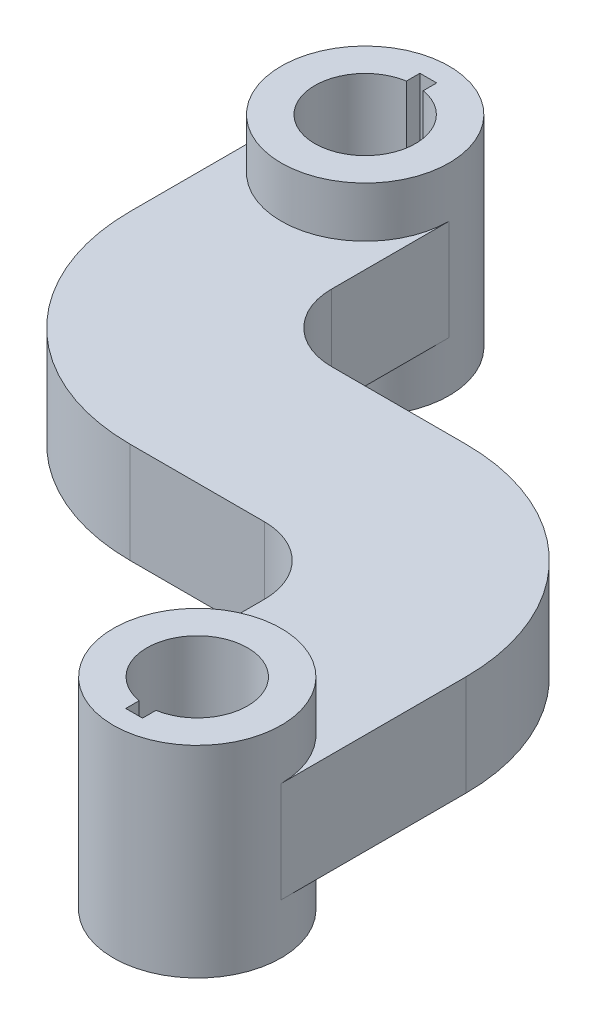
ISO-10303-21;
HEADER;
FILE_DESCRIPTION(('STEP AP214'),'2;1');
FILE_NAME('part.step','',(''),(''),'','','');
FILE_SCHEMA(('AUTOMOTIVE_DESIGN { 1 0 10303 214 1 1 1 1 }'));
ENDSEC;
DATA;
#1=APPLICATION_CONTEXT('core data for automotive mechanical design processes');
#2=APPLICATION_PROTOCOL_DEFINITION('international standard','automotive_design',2000,#1);
#3=PRODUCT_CONTEXT('',#1,'mechanical');
#4=PRODUCT('Part','Part','',(#3));
#5=PRODUCT_RELATED_PRODUCT_CATEGORY('part','',(#4));
#6=PRODUCT_DEFINITION_FORMATION('','',#4);
#7=PRODUCT_DEFINITION_CONTEXT('part definition',#1,'design');
#8=PRODUCT_DEFINITION('design','',#6,#7);
#9=PRODUCT_DEFINITION_SHAPE('','',#8);
#10=(LENGTH_UNIT() NAMED_UNIT(*) SI_UNIT(.MILLI.,.METRE.));
#11=(NAMED_UNIT(*) PLANE_ANGLE_UNIT() SI_UNIT($,.RADIAN.));
#12=(NAMED_UNIT(*) SI_UNIT($,.STERADIAN.) SOLID_ANGLE_UNIT());
#13=UNCERTAINTY_MEASURE_WITH_UNIT(LENGTH_MEASURE(1.E-05),#10,'distance_accuracy_value','');
#14=(GEOMETRIC_REPRESENTATION_CONTEXT(3) GLOBAL_UNCERTAINTY_ASSIGNED_CONTEXT((#13)) GLOBAL_UNIT_ASSIGNED_CONTEXT((#10,
#11,#12)) REPRESENTATION_CONTEXT('',''));
#15=CARTESIAN_POINT('',(0.,0.,0.));
#16=DIRECTION('',(0.,0.,1.));
#17=DIRECTION('',(1.,0.,0.));
#18=AXIS2_PLACEMENT_3D('',#15,#16,#17);
#19=CARTESIAN_POINT('',(19.05,19.05,57.15));
#20=DIRECTION('',(0.,-1.,0.));
#21=DIRECTION('',(0.,0.,-1.));
#22=AXIS2_PLACEMENT_3D('',#19,#20,#21);
#23=CYLINDRICAL_SURFACE('',#22,25.4);
#24=CARTESIAN_POINT('',(19.05,-19.05,57.15));
#25=DIRECTION('',(0.,-1.,0.));
#26=DIRECTION('',(0.,0.,1.));
#27=AXIS2_PLACEMENT_3D('',#24,#25,#26);
#28=CIRCLE('',#27,25.4);
#29=CARTESIAN_POINT('',(19.05,-19.05,31.75));
#30=VERTEX_POINT('',#29);
#31=CARTESIAN_POINT('',(44.45,-19.05,57.15));
#32=VERTEX_POINT('',#31);
#33=EDGE_CURVE('E297',#30,#32,#28,.T.);
#34=ORIENTED_EDGE('',*,*,#33,.T.);
#35=DIRECTION('',(0.,-1.,0.));
#36=VECTOR('',#35,1.);
#37=CARTESIAN_POINT('',(44.45,19.05,57.15));
#38=LINE('',#37,#36);
#39=CARTESIAN_POINT('',(44.45,19.05,57.15));
#40=VERTEX_POINT('',#39);
#41=EDGE_CURVE('E403',#40,#32,#38,.T.);
#42=ORIENTED_EDGE('',*,*,#41,.F.);
#43=CARTESIAN_POINT('',(19.05,19.05,57.15));
#44=DIRECTION('',(0.,-1.,0.));
#45=DIRECTION('',(0.,0.,1.));
#46=AXIS2_PLACEMENT_3D('',#43,#44,#45);
#47=CIRCLE('',#46,25.4);
#48=CARTESIAN_POINT('',(19.05,19.05,31.75));
#49=VERTEX_POINT('',#48);
#50=EDGE_CURVE('E302',#49,#40,#47,.T.);
#51=ORIENTED_EDGE('',*,*,#50,.F.);
#52=DIRECTION('',(0.,-1.,0.));
#53=VECTOR('',#52,1.);
#54=CARTESIAN_POINT('',(19.05,19.05,31.75));
#55=LINE('',#54,#53);
#56=EDGE_CURVE('E407',#49,#30,#55,.T.);
#57=ORIENTED_EDGE('',*,*,#56,.T.);
#58=EDGE_LOOP('',(#34,#42,#51,#57));
#59=FACE_BOUND('',#58,.T.);
#60=ADVANCED_FACE('F43',(#59),#23,.F.);
#61=CARTESIAN_POINT('',(44.45,19.05,114.3));
#62=DIRECTION('',(1.,0.,0.));
#63=DIRECTION('',(0.,0.,-1.));
#64=AXIS2_PLACEMENT_3D('',#61,#62,#63);
#65=PLANE('',#64);
#66=DIRECTION('',(0.,0.,1.));
#67=VECTOR('',#66,1.);
#68=CARTESIAN_POINT('',(44.45,-19.05,114.3));
#69=LINE('',#68,#67);
#70=CARTESIAN_POINT('',(44.45,-19.05,114.3));
#71=VERTEX_POINT('',#70);
#72=EDGE_CURVE('E335',#32,#71,#69,.T.);
#73=ORIENTED_EDGE('',*,*,#72,.T.);
#74=DIRECTION('',(0.,-1.,0.));
#75=VECTOR('',#74,1.);
#76=CARTESIAN_POINT('',(44.45,19.05,114.3));
#77=LINE('',#76,#75);
#78=CARTESIAN_POINT('',(44.45,19.05,114.3));
#79=VERTEX_POINT('',#78);
#80=EDGE_CURVE('E399',#79,#71,#77,.T.);
#81=ORIENTED_EDGE('',*,*,#80,.F.);
#82=DIRECTION('',(0.,0.,1.));
#83=VECTOR('',#82,1.);
#84=CARTESIAN_POINT('',(44.45,19.05,114.3));
#85=LINE('',#84,#83);
#86=EDGE_CURVE('E306',#40,#79,#85,.T.);
#87=ORIENTED_EDGE('',*,*,#86,.F.);
#88=ORIENTED_EDGE('',*,*,#41,.T.);
#89=EDGE_LOOP('',(#73,#81,#87,#88));
#90=FACE_BOUND('',#89,.T.);
#91=ADVANCED_FACE('F467',(#90),#65,.F.);
#92=CARTESIAN_POINT('',(76.2,19.05,114.3));
#93=DIRECTION('',(0.,-1.,0.));
#94=DIRECTION('',(0.,0.,-1.));
#95=AXIS2_PLACEMENT_3D('',#92,#93,#94);
#96=CYLINDRICAL_SURFACE('',#95,31.75);
#97=ORIENTED_EDGE('',*,*,#80,.T.);
#98=CARTESIAN_POINT('',(76.2,-19.05,114.3));
#99=DIRECTION('',(0.,-1.,0.));
#100=DIRECTION('',(0.,0.,-1.));
#101=AXIS2_PLACEMENT_3D('',#98,#99,#100);
#102=CIRCLE('',#101,31.75);
#103=CARTESIAN_POINT('',(107.95,-19.05,114.3));
#104=VERTEX_POINT('',#103);
#105=EDGE_CURVE('E11',#71,#104,#102,.T.);
#106=ORIENTED_EDGE('',*,*,#105,.T.);
#107=DIRECTION('',(0.,-1.,0.));
#108=VECTOR('',#107,1.);
#109=CARTESIAN_POINT('',(107.95,19.05,114.3));
#110=LINE('',#109,#108);
#111=CARTESIAN_POINT('',(107.95,19.05,114.3));
#112=VERTEX_POINT('',#111);
#113=EDGE_CURVE('E395',#112,#104,#110,.T.);
#114=ORIENTED_EDGE('',*,*,#113,.F.);
#115=CARTESIAN_POINT('',(76.2,19.05,114.3));
#116=DIRECTION('',(0.,-1.,0.));
#117=DIRECTION('',(0.,0.,-1.));
#118=AXIS2_PLACEMENT_3D('',#115,#116,#117);
#119=CIRCLE('',#118,31.75);
#120=EDGE_CURVE('E282',#79,#112,#119,.T.);
#121=ORIENTED_EDGE('',*,*,#120,.F.);
#122=EDGE_LOOP('',(#97,#106,#114,#121));
#123=FACE_BOUND('',#122,.T.);
#124=CARTESIAN_POINT('',(76.2,-38.1,114.3));
#125=DIRECTION('',(0.,1.,0.));
#126=DIRECTION('',(0.,0.,1.));
#127=AXIS2_PLACEMENT_3D('',#124,#125,#126);
#128=CIRCLE('',#127,31.75);
#129=CARTESIAN_POINT('',(76.2,-38.1,146.05));
#130=VERTEX_POINT('',#129);
#131=EDGE_CURVE('E278',#130,#130,#128,.T.);
#132=ORIENTED_EDGE('',*,*,#131,.T.);
#133=EDGE_LOOP('',(#132));
#134=FACE_BOUND('',#133,.T.);
#135=CARTESIAN_POINT('',(76.2,38.1,114.3));
#136=DIRECTION('',(0.,1.,0.));
#137=DIRECTION('',(0.,0.,1.));
#138=AXIS2_PLACEMENT_3D('',#135,#136,#137);
#139=CIRCLE('',#138,31.75);
#140=CARTESIAN_POINT('',(76.2,38.1,146.05));
#141=VERTEX_POINT('',#140);
#142=EDGE_CURVE('E226',#141,#141,#139,.T.);
#143=ORIENTED_EDGE('',*,*,#142,.F.);
#144=EDGE_LOOP('',(#143));
#145=FACE_BOUND('',#144,.T.);
#146=ADVANCED_FACE('F462',(#123,#134,#145),#96,.T.);
#147=CARTESIAN_POINT('',(107.95,19.05,44.45));
#148=DIRECTION('',(-1.,0.,0.));
#149=DIRECTION('',(0.,0.,1.));
#150=AXIS2_PLACEMENT_3D('',#147,#148,#149);
#151=PLANE('',#150);
#152=DIRECTION('',(0.,0.,-1.));
#153=VECTOR('',#152,1.);
#154=CARTESIAN_POINT('',(107.95,-19.05,44.45));
#155=LINE('',#154,#153);
#156=CARTESIAN_POINT('',(107.95,-19.05,44.45));
#157=VERTEX_POINT('',#156);
#158=EDGE_CURVE('E339',#104,#157,#155,.T.);
#159=ORIENTED_EDGE('',*,*,#158,.T.);
#160=DIRECTION('',(0.,-1.,0.));
#161=VECTOR('',#160,1.);
#162=CARTESIAN_POINT('',(107.95,19.05,44.45));
#163=LINE('',#162,#161);
#164=CARTESIAN_POINT('',(107.95,19.05,44.45));
#165=VERTEX_POINT('',#164);
#166=EDGE_CURVE('E391',#165,#157,#163,.T.);
#167=ORIENTED_EDGE('',*,*,#166,.F.);
#168=DIRECTION('',(0.,0.,-1.));
#169=VECTOR('',#168,1.);
#170=CARTESIAN_POINT('',(107.95,19.05,44.45));
#171=LINE('',#170,#169);
#172=EDGE_CURVE('E310',#112,#165,#171,.T.);
#173=ORIENTED_EDGE('',*,*,#172,.F.);
#174=ORIENTED_EDGE('',*,*,#113,.T.);
#175=EDGE_LOOP('',(#159,#167,#173,#174));
#176=FACE_BOUND('',#175,.T.);
#177=ADVANCED_FACE('F460',(#176),#151,.F.);
#178=CARTESIAN_POINT('',(31.75,19.05,44.45));
#179=DIRECTION('',(0.,-1.,0.));
#180=DIRECTION('',(0.,0.,-1.));
#181=AXIS2_PLACEMENT_3D('',#178,#179,#180);
#182=CYLINDRICAL_SURFACE('',#181,76.2);
#183=CARTESIAN_POINT('',(31.75,-19.05,44.45));
#184=DIRECTION('',(0.,1.,0.));
#185=DIRECTION('',(0.,0.,-1.));
#186=AXIS2_PLACEMENT_3D('',#183,#184,#185);
#187=CIRCLE('',#186,76.2);
#188=CARTESIAN_POINT('',(31.75,-19.05,-31.75));
#189=VERTEX_POINT('',#188);
#190=EDGE_CURVE('E342',#157,#189,#187,.T.);
#191=ORIENTED_EDGE('',*,*,#190,.T.);
#192=DIRECTION('',(0.,-1.,0.));
#193=VECTOR('',#192,1.);
#194=CARTESIAN_POINT('',(31.75,19.05,-31.75));
#195=LINE('',#194,#193);
#196=CARTESIAN_POINT('',(31.75,19.05,-31.75));
#197=VERTEX_POINT('',#196);
#198=EDGE_CURVE('E387',#197,#189,#195,.T.);
#199=ORIENTED_EDGE('',*,*,#198,.F.);
#200=CARTESIAN_POINT('',(31.75,19.05,44.45));
#201=DIRECTION('',(0.,1.,0.));
#202=DIRECTION('',(0.,0.,-1.));
#203=AXIS2_PLACEMENT_3D('',#200,#201,#202);
#204=CIRCLE('',#203,76.2);
#205=EDGE_CURVE('E313',#165,#197,#204,.T.);
#206=ORIENTED_EDGE('',*,*,#205,.F.);
#207=ORIENTED_EDGE('',*,*,#166,.T.);
#208=EDGE_LOOP('',(#191,#199,#206,#207));
#209=FACE_BOUND('',#208,.T.);
#210=ADVANCED_FACE('F454',(#209),#182,.T.);
#211=CARTESIAN_POINT('',(-19.0499999999998,19.05,-31.75));
#212=DIRECTION('',(0.,0.,1.));
#213=DIRECTION('',(1.,0.,0.));
#214=AXIS2_PLACEMENT_3D('',#211,#212,#213);
#215=PLANE('',#214);
#216=DIRECTION('',(-1.,0.,0.));
#217=VECTOR('',#216,1.);
#218=CARTESIAN_POINT('',(-19.0499999999998,-19.05,-31.75));
#219=LINE('',#218,#217);
#220=CARTESIAN_POINT('',(-19.05,-19.05,-31.75));
#221=VERTEX_POINT('',#220);
#222=EDGE_CURVE('E346',#189,#221,#219,.T.);
#223=ORIENTED_EDGE('',*,*,#222,.T.);
#224=DIRECTION('',(0.,-1.,0.));
#225=VECTOR('',#224,1.);
#226=CARTESIAN_POINT('',(-19.05,19.05,-31.75));
#227=LINE('',#226,#225);
#228=CARTESIAN_POINT('',(-19.05,19.05,-31.75));
#229=VERTEX_POINT('',#228);
#230=EDGE_CURVE('E383',#229,#221,#227,.T.);
#231=ORIENTED_EDGE('',*,*,#230,.F.);
#232=DIRECTION('',(-1.,0.,0.));
#233=VECTOR('',#232,1.);
#234=CARTESIAN_POINT('',(0.,19.05,-31.75));
#235=LINE('',#234,#233);
#236=EDGE_CURVE('E316',#197,#229,#235,.T.);
#237=ORIENTED_EDGE('',*,*,#236,.F.);
#238=ORIENTED_EDGE('',*,*,#198,.T.);
#239=EDGE_LOOP('',(#223,#231,#237,#238));
#240=FACE_BOUND('',#239,.T.);
#241=ADVANCED_FACE('F450',(#240),#215,.F.);
#242=CARTESIAN_POINT('',(-19.05,19.05,-57.15));
#243=DIRECTION('',(0.,-1.,0.));
#244=DIRECTION('',(0.,0.,-1.));
#245=AXIS2_PLACEMENT_3D('',#242,#243,#244);
#246=CYLINDRICAL_SURFACE('',#245,25.4);
#247=CARTESIAN_POINT('',(-19.05,-19.05,-57.15));
#248=DIRECTION('',(0.,-1.,0.));
#249=DIRECTION('',(0.,0.,1.));
#250=AXIS2_PLACEMENT_3D('',#247,#248,#249);
#251=CIRCLE('',#250,25.4);
#252=CARTESIAN_POINT('',(-44.45,-19.05,-57.1500000000002));
#253=VERTEX_POINT('',#252);
#254=EDGE_CURVE('E349',#221,#253,#251,.T.);
#255=ORIENTED_EDGE('',*,*,#254,.T.);
#256=DIRECTION('',(0.,-1.,0.));
#257=VECTOR('',#256,1.);
#258=CARTESIAN_POINT('',(-44.45,19.05,-57.1500000000002));
#259=LINE('',#258,#257);
#260=CARTESIAN_POINT('',(-44.45,19.05,-57.1500000000002));
#261=VERTEX_POINT('',#260);
#262=EDGE_CURVE('E379',#261,#253,#259,.T.);
#263=ORIENTED_EDGE('',*,*,#262,.F.);
#264=CARTESIAN_POINT('',(-19.05,19.05,-57.15));
#265=DIRECTION('',(0.,-1.,0.));
#266=DIRECTION('',(0.,0.,1.));
#267=AXIS2_PLACEMENT_3D('',#264,#265,#266);
#268=CIRCLE('',#267,25.4);
#269=EDGE_CURVE('E319',#229,#261,#268,.T.);
#270=ORIENTED_EDGE('',*,*,#269,.F.);
#271=ORIENTED_EDGE('',*,*,#230,.T.);
#272=EDGE_LOOP('',(#255,#263,#270,#271));
#273=FACE_BOUND('',#272,.T.);
#274=ADVANCED_FACE('F446',(#273),#246,.F.);
#275=CARTESIAN_POINT('',(-44.45,19.05,-101.6));
#276=DIRECTION('',(-1.,0.,0.));
#277=DIRECTION('',(0.,0.,1.));
#278=AXIS2_PLACEMENT_3D('',#275,#276,#277);
#279=PLANE('',#278);
#280=DIRECTION('',(0.,0.,-1.));
#281=VECTOR('',#280,1.);
#282=CARTESIAN_POINT('',(-44.45,-19.05,-101.6));
#283=LINE('',#282,#281);
#284=CARTESIAN_POINT('',(-44.45,-19.05,-101.6));
#285=VERTEX_POINT('',#284);
#286=EDGE_CURVE('E352',#253,#285,#283,.T.);
#287=ORIENTED_EDGE('',*,*,#286,.T.);
#288=DIRECTION('',(0.,-1.,0.));
#289=VECTOR('',#288,1.);
#290=CARTESIAN_POINT('',(-44.45,19.05,-101.6));
#291=LINE('',#290,#289);
#292=CARTESIAN_POINT('',(-44.45,19.05,-101.6));
#293=VERTEX_POINT('',#292);
#294=EDGE_CURVE('E375',#293,#285,#291,.T.);
#295=ORIENTED_EDGE('',*,*,#294,.F.);
#296=DIRECTION('',(0.,0.,-1.));
#297=VECTOR('',#296,1.);
#298=CARTESIAN_POINT('',(-44.45,19.05,-101.6));
#299=LINE('',#298,#297);
#300=EDGE_CURVE('E322',#261,#293,#299,.T.);
#301=ORIENTED_EDGE('',*,*,#300,.F.);
#302=ORIENTED_EDGE('',*,*,#262,.T.);
#303=EDGE_LOOP('',(#287,#295,#301,#302));
#304=FACE_BOUND('',#303,.T.);
#305=ADVANCED_FACE('F442',(#304),#279,.F.);
#306=CARTESIAN_POINT('',(-76.2,19.05,-101.6));
#307=DIRECTION('',(0.,-1.,0.));
#308=DIRECTION('',(0.,0.,-1.));
#309=AXIS2_PLACEMENT_3D('',#306,#307,#308);
#310=CYLINDRICAL_SURFACE('',#309,31.75);
#311=ORIENTED_EDGE('',*,*,#294,.T.);
#312=CARTESIAN_POINT('',(-76.2,-19.05,-101.6));
#313=DIRECTION('',(0.,-1.,0.));
#314=DIRECTION('',(0.,0.,-1.));
#315=AXIS2_PLACEMENT_3D('',#312,#313,#314);
#316=CIRCLE('',#315,31.75);
#317=CARTESIAN_POINT('',(-107.95,-19.05,-101.6));
#318=VERTEX_POINT('',#317);
#319=EDGE_CURVE('E51',#285,#318,#316,.T.);
#320=ORIENTED_EDGE('',*,*,#319,.T.);
#321=DIRECTION('',(0.,-1.,0.));
#322=VECTOR('',#321,1.);
#323=CARTESIAN_POINT('',(-107.95,19.05,-101.6));
#324=LINE('',#323,#322);
#325=CARTESIAN_POINT('',(-107.95,19.05,-101.6));
#326=VERTEX_POINT('',#325);
#327=EDGE_CURVE('E371',#326,#318,#324,.T.);
#328=ORIENTED_EDGE('',*,*,#327,.F.);
#329=CARTESIAN_POINT('',(-76.2,19.05,-101.6));
#330=DIRECTION('',(0.,-1.,0.));
#331=DIRECTION('',(0.,0.,-1.));
#332=AXIS2_PLACEMENT_3D('',#329,#330,#331);
#333=CIRCLE('',#332,31.75);
#334=EDGE_CURVE('E293',#293,#326,#333,.T.);
#335=ORIENTED_EDGE('',*,*,#334,.F.);
#336=EDGE_LOOP('',(#311,#320,#328,#335));
#337=FACE_BOUND('',#336,.T.);
#338=CARTESIAN_POINT('',(-76.2,-38.1,-101.6));
#339=DIRECTION('',(0.,1.,0.));
#340=DIRECTION('',(0.,0.,1.));
#341=AXIS2_PLACEMENT_3D('',#338,#339,#340);
#342=CIRCLE('',#341,31.75);
#343=CARTESIAN_POINT('',(-76.2,-38.1,-69.85));
#344=VERTEX_POINT('',#343);
#345=EDGE_CURVE('E289',#344,#344,#342,.T.);
#346=ORIENTED_EDGE('',*,*,#345,.T.);
#347=EDGE_LOOP('',(#346));
#348=FACE_BOUND('',#347,.T.);
#349=CARTESIAN_POINT('',(-76.2,38.1,-101.6));
#350=DIRECTION('',(0.,1.,0.));
#351=DIRECTION('',(0.,0.,1.));
#352=AXIS2_PLACEMENT_3D('',#349,#350,#351);
#353=CIRCLE('',#352,31.75);
#354=CARTESIAN_POINT('',(-76.2,38.1,-69.85));
#355=VERTEX_POINT('',#354);
#356=EDGE_CURVE('E285',#355,#355,#353,.T.);
#357=ORIENTED_EDGE('',*,*,#356,.F.);
#358=EDGE_LOOP('',(#357));
#359=FACE_BOUND('',#358,.T.);
#360=ADVANCED_FACE('F415',(#337,#348,#359),#310,.T.);
#361=CARTESIAN_POINT('',(-107.95,19.05,-44.4500000000005));
#362=DIRECTION('',(1.,0.,0.));
#363=DIRECTION('',(0.,0.,-1.));
#364=AXIS2_PLACEMENT_3D('',#361,#362,#363);
#365=PLANE('',#364);
#366=DIRECTION('',(0.,0.,1.));
#367=VECTOR('',#366,1.);
#368=CARTESIAN_POINT('',(-107.95,-19.05,-44.4500000000005));
#369=LINE('',#368,#367);
#370=CARTESIAN_POINT('',(-107.95,-19.05,-44.4500000000005));
#371=VERTEX_POINT('',#370);
#372=EDGE_CURVE('E356',#318,#371,#369,.T.);
#373=ORIENTED_EDGE('',*,*,#372,.T.);
#374=DIRECTION('',(0.,-1.,0.));
#375=VECTOR('',#374,1.);
#376=CARTESIAN_POINT('',(-107.95,19.05,-44.4500000000005));
#377=LINE('',#376,#375);
#378=CARTESIAN_POINT('',(-107.95,19.05,-44.4500000000005));
#379=VERTEX_POINT('',#378);
#380=EDGE_CURVE('E367',#379,#371,#377,.T.);
#381=ORIENTED_EDGE('',*,*,#380,.F.);
#382=DIRECTION('',(0.,0.,1.));
#383=VECTOR('',#382,1.);
#384=CARTESIAN_POINT('',(-107.95,19.05,-44.4500000000005));
#385=LINE('',#384,#383);
#386=EDGE_CURVE('E325',#326,#379,#385,.T.);
#387=ORIENTED_EDGE('',*,*,#386,.F.);
#388=ORIENTED_EDGE('',*,*,#327,.T.);
#389=EDGE_LOOP('',(#373,#381,#387,#388));
#390=FACE_BOUND('',#389,.T.);
#391=ADVANCED_FACE('F423',(#390),#365,.F.);
#392=CARTESIAN_POINT('',(-31.75,19.05,-44.45));
#393=DIRECTION('',(0.,-1.,0.));
#394=DIRECTION('',(0.,0.,-1.));
#395=AXIS2_PLACEMENT_3D('',#392,#393,#394);
#396=CYLINDRICAL_SURFACE('',#395,76.2);
#397=CARTESIAN_POINT('',(-31.75,-19.05,-44.45));
#398=DIRECTION('',(0.,1.,0.));
#399=DIRECTION('',(0.,0.,-1.));
#400=AXIS2_PLACEMENT_3D('',#397,#398,#399);
#401=CIRCLE('',#400,76.2);
#402=CARTESIAN_POINT('',(-31.7499999999995,-19.05,31.75));
#403=VERTEX_POINT('',#402);
#404=EDGE_CURVE('E359',#371,#403,#401,.T.);
#405=ORIENTED_EDGE('',*,*,#404,.T.);
#406=DIRECTION('',(0.,-1.,0.));
#407=VECTOR('',#406,1.);
#408=CARTESIAN_POINT('',(-31.7499999999995,19.05,31.75));
#409=LINE('',#408,#407);
#410=CARTESIAN_POINT('',(-31.7499999999995,19.05,31.75));
#411=VERTEX_POINT('',#410);
#412=EDGE_CURVE('E332',#411,#403,#409,.T.);
#413=ORIENTED_EDGE('',*,*,#412,.F.);
#414=CARTESIAN_POINT('',(-31.75,19.05,-44.45));
#415=DIRECTION('',(0.,1.,0.));
#416=DIRECTION('',(0.,0.,-1.));
#417=AXIS2_PLACEMENT_3D('',#414,#415,#416);
#418=CIRCLE('',#417,76.2);
#419=EDGE_CURVE('E328',#379,#411,#418,.T.);
#420=ORIENTED_EDGE('',*,*,#419,.F.);
#421=ORIENTED_EDGE('',*,*,#380,.T.);
#422=EDGE_LOOP('',(#405,#413,#420,#421));
#423=FACE_BOUND('',#422,.T.);
#424=ADVANCED_FACE('F431',(#423),#396,.T.);
#425=CARTESIAN_POINT('',(0.,19.05,31.75));
#426=DIRECTION('',(0.,0.,-1.));
#427=DIRECTION('',(-1.,0.,0.));
#428=AXIS2_PLACEMENT_3D('',#425,#426,#427);
#429=PLANE('',#428);
#430=DIRECTION('',(1.,0.,0.));
#431=VECTOR('',#430,1.);
#432=CARTESIAN_POINT('',(0.,-19.05,31.75));
#433=LINE('',#432,#431);
#434=EDGE_CURVE('E303',#403,#30,#433,.T.);
#435=ORIENTED_EDGE('',*,*,#434,.T.);
#436=ORIENTED_EDGE('',*,*,#56,.F.);
#437=DIRECTION('',(1.,0.,0.));
#438=VECTOR('',#437,1.);
#439=CARTESIAN_POINT('',(19.05,19.05,31.75));
#440=LINE('',#439,#438);
#441=EDGE_CURVE('E298',#411,#49,#440,.T.);
#442=ORIENTED_EDGE('',*,*,#441,.F.);
#443=ORIENTED_EDGE('',*,*,#412,.T.);
#444=EDGE_LOOP('',(#435,#436,#442,#443));
#445=FACE_BOUND('',#444,.T.);
#446=ADVANCED_FACE('F434',(#445),#429,.F.);
#447=CARTESIAN_POINT('',(-31.75,19.05,-44.45));
#448=DIRECTION('',(0.,-1.,0.));
#449=DIRECTION('',(0.,0.,-1.));
#450=AXIS2_PLACEMENT_3D('',#447,#448,#449);
#451=PLANE('',#450);
#452=ORIENTED_EDGE('',*,*,#86,.T.);
#453=ORIENTED_EDGE('',*,*,#120,.T.);
#454=ORIENTED_EDGE('',*,*,#172,.T.);
#455=ORIENTED_EDGE('',*,*,#205,.T.);
#456=ORIENTED_EDGE('',*,*,#236,.T.);
#457=ORIENTED_EDGE('',*,*,#269,.T.);
#458=ORIENTED_EDGE('',*,*,#300,.T.);
#459=ORIENTED_EDGE('',*,*,#334,.T.);
#460=ORIENTED_EDGE('',*,*,#386,.T.);
#461=ORIENTED_EDGE('',*,*,#419,.T.);
#462=ORIENTED_EDGE('',*,*,#441,.T.);
#463=ORIENTED_EDGE('',*,*,#50,.T.);
#464=EDGE_LOOP('',(#452,#453,#454,#455,#456,#457,#458,#459,#460,#461,#462,#463));
#465=FACE_BOUND('',#464,.T.);
#466=ADVANCED_FACE('F437',(#465),#451,.F.);
#467=CARTESIAN_POINT('',(-31.75,-19.05,-44.45));
#468=DIRECTION('',(0.,-1.,0.));
#469=DIRECTION('',(0.,0.,-1.));
#470=AXIS2_PLACEMENT_3D('',#467,#468,#469);
#471=PLANE('',#470);
#472=ORIENTED_EDGE('',*,*,#105,.F.);
#473=ORIENTED_EDGE('',*,*,#72,.F.);
#474=ORIENTED_EDGE('',*,*,#33,.F.);
#475=ORIENTED_EDGE('',*,*,#434,.F.);
#476=ORIENTED_EDGE('',*,*,#404,.F.);
#477=ORIENTED_EDGE('',*,*,#372,.F.);
#478=ORIENTED_EDGE('',*,*,#319,.F.);
#479=ORIENTED_EDGE('',*,*,#286,.F.);
#480=ORIENTED_EDGE('',*,*,#254,.F.);
#481=ORIENTED_EDGE('',*,*,#222,.F.);
#482=ORIENTED_EDGE('',*,*,#190,.F.);
#483=ORIENTED_EDGE('',*,*,#158,.F.);
#484=EDGE_LOOP('',(#472,#473,#474,#475,#476,#477,#478,#479,#480,#481,#482,#483));
#485=FACE_BOUND('',#484,.T.);
#486=ADVANCED_FACE('F426',(#485),#471,.T.);
#487=CARTESIAN_POINT('',(-76.2,-38.1,-101.6));
#488=DIRECTION('',(0.,1.,0.));
#489=DIRECTION('',(0.,0.,1.));
#490=AXIS2_PLACEMENT_3D('',#487,#488,#489);
#491=PLANE('',#490);
#492=CARTESIAN_POINT('',(-76.2,-38.1,-101.6));
#493=DIRECTION('',(0.,1.,0.));
#494=DIRECTION('',(0.,0.,1.));
#495=AXIS2_PLACEMENT_3D('',#492,#493,#494);
#496=CIRCLE('',#495,19.05);
#497=CARTESIAN_POINT('',(-79.375,-38.1,-120.383553311341));
#498=VERTEX_POINT('',#497);
#499=CARTESIAN_POINT('',(-73.025,-38.1,-120.383553311341));
#500=VERTEX_POINT('',#499);
#501=EDGE_CURVE('E189',#498,#500,#496,.T.);
#502=ORIENTED_EDGE('',*,*,#501,.T.);
#503=DIRECTION('',(0.,0.,-1.));
#504=VECTOR('',#503,1.);
#505=CARTESIAN_POINT('',(-73.025,-38.1,-125.476));
#506=LINE('',#505,#504);
#507=CARTESIAN_POINT('',(-73.025,-38.1,-125.476));
#508=VERTEX_POINT('',#507);
#509=EDGE_CURVE('E182',#500,#508,#506,.T.);
#510=ORIENTED_EDGE('',*,*,#509,.T.);
#511=DIRECTION('',(-1.,0.,0.));
#512=VECTOR('',#511,1.);
#513=CARTESIAN_POINT('',(-79.375,-38.1,-125.476));
#514=LINE('',#513,#512);
#515=CARTESIAN_POINT('',(-79.375,-38.1,-125.476));
#516=VERTEX_POINT('',#515);
#517=EDGE_CURVE('E192',#508,#516,#514,.T.);
#518=ORIENTED_EDGE('',*,*,#517,.T.);
#519=DIRECTION('',(0.,0.,1.));
#520=VECTOR('',#519,1.);
#521=CARTESIAN_POINT('',(-79.375,-38.1,-125.476));
#522=LINE('',#521,#520);
#523=EDGE_CURVE('E58',#516,#498,#522,.T.);
#524=ORIENTED_EDGE('',*,*,#523,.T.);
#525=EDGE_LOOP('',(#502,#510,#518,#524));
#526=FACE_BOUND('',#525,.T.);
#527=ORIENTED_EDGE('',*,*,#345,.F.);
#528=EDGE_LOOP('',(#527));
#529=FACE_BOUND('',#528,.T.);
#530=ADVANCED_FACE('F197',(#526,#529),#491,.F.);
#531=CARTESIAN_POINT('',(-76.2,38.1,-101.6));
#532=DIRECTION('',(0.,1.,0.));
#533=DIRECTION('',(0.,0.,1.));
#534=AXIS2_PLACEMENT_3D('',#531,#532,#533);
#535=PLANE('',#534);
#536=DIRECTION('',(0.,0.,-1.));
#537=VECTOR('',#536,1.);
#538=CARTESIAN_POINT('',(-73.025,38.1,-125.476));
#539=LINE('',#538,#537);
#540=CARTESIAN_POINT('',(-73.025,38.1,-120.383553311341));
#541=VERTEX_POINT('',#540);
#542=CARTESIAN_POINT('',(-73.025,38.1,-125.476));
#543=VERTEX_POINT('',#542);
#544=EDGE_CURVE('E66',#541,#543,#539,.T.);
#545=ORIENTED_EDGE('',*,*,#544,.F.);
#546=CARTESIAN_POINT('',(-76.2,38.1,-101.6));
#547=DIRECTION('',(0.,1.,0.));
#548=DIRECTION('',(0.,0.,1.));
#549=AXIS2_PLACEMENT_3D('',#546,#547,#548);
#550=CIRCLE('',#549,19.05);
#551=CARTESIAN_POINT('',(-79.375,38.1,-120.383553311341));
#552=VERTEX_POINT('',#551);
#553=EDGE_CURVE('E201',#552,#541,#550,.T.);
#554=ORIENTED_EDGE('',*,*,#553,.F.);
#555=DIRECTION('',(0.,0.,1.));
#556=VECTOR('',#555,1.);
#557=CARTESIAN_POINT('',(-79.375,38.1,-125.476));
#558=LINE('',#557,#556);
#559=CARTESIAN_POINT('',(-79.375,38.1,-125.476));
#560=VERTEX_POINT('',#559);
#561=EDGE_CURVE('E207',#560,#552,#558,.T.);
#562=ORIENTED_EDGE('',*,*,#561,.F.);
#563=DIRECTION('',(-1.,0.,0.));
#564=VECTOR('',#563,1.);
#565=CARTESIAN_POINT('',(-79.375,38.1,-125.476));
#566=LINE('',#565,#564);
#567=EDGE_CURVE('E216',#543,#560,#566,.T.);
#568=ORIENTED_EDGE('',*,*,#567,.F.);
#569=EDGE_LOOP('',(#545,#554,#562,#568));
#570=FACE_BOUND('',#569,.T.);
#571=ORIENTED_EDGE('',*,*,#356,.T.);
#572=EDGE_LOOP('',(#571));
#573=FACE_BOUND('',#572,.T.);
#574=ADVANCED_FACE('F503',(#570,#573),#535,.T.);
#575=CARTESIAN_POINT('',(76.2,-38.1,114.3));
#576=DIRECTION('',(0.,1.,0.));
#577=DIRECTION('',(0.,0.,1.));
#578=AXIS2_PLACEMENT_3D('',#575,#576,#577);
#579=PLANE('',#578);
#580=DIRECTION('',(1.,0.,0.));
#581=VECTOR('',#580,1.);
#582=CARTESIAN_POINT('',(73.0249999999994,-38.1,138.176));
#583=LINE('',#582,#581);
#584=CARTESIAN_POINT('',(73.0249999999994,-38.1,138.176));
#585=VERTEX_POINT('',#584);
#586=CARTESIAN_POINT('',(79.3749999999994,-38.1,138.176));
#587=VERTEX_POINT('',#586);
#588=EDGE_CURVE('E245',#585,#587,#583,.T.);
#589=ORIENTED_EDGE('',*,*,#588,.T.);
#590=DIRECTION('',(1.1445718012646E-13,0.,-1.));
#591=VECTOR('',#590,1.);
#592=CARTESIAN_POINT('',(79.3749999999994,-38.1,138.176));
#593=LINE('',#592,#591);
#594=CARTESIAN_POINT('',(79.375,-38.1,133.083553311341));
#595=VERTEX_POINT('',#594);
#596=EDGE_CURVE('E232',#587,#595,#593,.T.);
#597=ORIENTED_EDGE('',*,*,#596,.T.);
#598=CARTESIAN_POINT('',(76.2,-38.1,114.3));
#599=DIRECTION('',(0.,1.,0.));
#600=DIRECTION('',(0.,0.,1.));
#601=AXIS2_PLACEMENT_3D('',#598,#599,#600);
#602=CIRCLE('',#601,19.05);
#603=CARTESIAN_POINT('',(73.025,-38.1,133.083553311341));
#604=VERTEX_POINT('',#603);
#605=EDGE_CURVE('E236',#595,#604,#602,.T.);
#606=ORIENTED_EDGE('',*,*,#605,.T.);
#607=DIRECTION('',(-1.1445718012646E-13,0.,1.));
#608=VECTOR('',#607,1.);
#609=CARTESIAN_POINT('',(73.0249999999994,-38.1,138.176));
#610=LINE('',#609,#608);
#611=EDGE_CURVE('E241',#604,#585,#610,.T.);
#612=ORIENTED_EDGE('',*,*,#611,.T.);
#613=EDGE_LOOP('',(#589,#597,#606,#612));
#614=FACE_BOUND('',#613,.T.);
#615=ORIENTED_EDGE('',*,*,#131,.F.);
#616=EDGE_LOOP('',(#615));
#617=FACE_BOUND('',#616,.T.);
#618=ADVANCED_FACE('F506',(#614,#617),#579,.F.);
#619=CARTESIAN_POINT('',(76.2,38.1,114.3));
#620=DIRECTION('',(0.,1.,0.));
#621=DIRECTION('',(0.,0.,1.));
#622=AXIS2_PLACEMENT_3D('',#619,#620,#621);
#623=PLANE('',#622);
#624=DIRECTION('',(1.1445718012646E-13,0.,-1.));
#625=VECTOR('',#624,1.);
#626=CARTESIAN_POINT('',(79.3749999999994,38.1,138.176));
#627=LINE('',#626,#625);
#628=CARTESIAN_POINT('',(79.3749999999994,38.1,138.176));
#629=VERTEX_POINT('',#628);
#630=CARTESIAN_POINT('',(79.375,38.1,133.083553311341));
#631=VERTEX_POINT('',#630);
#632=EDGE_CURVE('E250',#629,#631,#627,.T.);
#633=ORIENTED_EDGE('',*,*,#632,.F.);
#634=DIRECTION('',(1.,0.,0.));
#635=VECTOR('',#634,1.);
#636=CARTESIAN_POINT('',(73.0249999999994,38.1,138.176));
#637=LINE('',#636,#635);
#638=CARTESIAN_POINT('',(73.0249999999994,38.1,138.176));
#639=VERTEX_POINT('',#638);
#640=EDGE_CURVE('E237',#639,#629,#637,.T.);
#641=ORIENTED_EDGE('',*,*,#640,.F.);
#642=DIRECTION('',(-1.1445718012646E-13,0.,1.));
#643=VECTOR('',#642,1.);
#644=CARTESIAN_POINT('',(73.0249999999994,38.1,138.176));
#645=LINE('',#644,#643);
#646=CARTESIAN_POINT('',(73.025,38.1,133.083553311341));
#647=VERTEX_POINT('',#646);
#648=EDGE_CURVE('E257',#647,#639,#645,.T.);
#649=ORIENTED_EDGE('',*,*,#648,.F.);
#650=CARTESIAN_POINT('',(76.2,38.1,114.3));
#651=DIRECTION('',(0.,1.,0.));
#652=DIRECTION('',(0.,0.,1.));
#653=AXIS2_PLACEMENT_3D('',#650,#651,#652);
#654=CIRCLE('',#653,19.05);
#655=EDGE_CURVE('E253',#631,#647,#654,.T.);
#656=ORIENTED_EDGE('',*,*,#655,.F.);
#657=EDGE_LOOP('',(#633,#641,#649,#656));
#658=FACE_BOUND('',#657,.T.);
#659=ORIENTED_EDGE('',*,*,#142,.T.);
#660=EDGE_LOOP('',(#659));
#661=FACE_BOUND('',#660,.T.);
#662=ADVANCED_FACE('F510',(#658,#661),#623,.T.);
#663=CARTESIAN_POINT('',(79.3749999999994,-38.1,138.176));
#664=DIRECTION('',(1.,0.,1.1445718012646E-13));
#665=DIRECTION('',(1.1445718012646E-13,0.,-1.));
#666=AXIS2_PLACEMENT_3D('',#663,#664,#665);
#667=PLANE('',#666);
#668=ORIENTED_EDGE('',*,*,#632,.T.);
#669=DIRECTION('',(0.,1.,0.));
#670=VECTOR('',#669,1.);
#671=CARTESIAN_POINT('',(79.375,-38.1,133.083553311341));
#672=LINE('',#671,#670);
#673=EDGE_CURVE('E249',#595,#631,#672,.T.);
#674=ORIENTED_EDGE('',*,*,#673,.F.);
#675=ORIENTED_EDGE('',*,*,#596,.F.);
#676=DIRECTION('',(0.,1.,0.));
#677=VECTOR('',#676,1.);
#678=CARTESIAN_POINT('',(79.3749999999994,-38.1,138.176));
#679=LINE('',#678,#677);
#680=EDGE_CURVE('E217',#587,#629,#679,.T.);
#681=ORIENTED_EDGE('',*,*,#680,.T.);
#682=EDGE_LOOP('',(#668,#674,#675,#681));
#683=FACE_BOUND('',#682,.T.);
#684=ADVANCED_FACE('F514',(#683),#667,.F.);
#685=CARTESIAN_POINT('',(73.0249999999994,-38.1,138.176));
#686=DIRECTION('',(0.,0.,1.));
#687=DIRECTION('',(1.,0.,0.));
#688=AXIS2_PLACEMENT_3D('',#685,#686,#687);
#689=PLANE('',#688);
#690=ORIENTED_EDGE('',*,*,#640,.T.);
#691=ORIENTED_EDGE('',*,*,#680,.F.);
#692=ORIENTED_EDGE('',*,*,#588,.F.);
#693=DIRECTION('',(0.,1.,0.));
#694=VECTOR('',#693,1.);
#695=CARTESIAN_POINT('',(73.0249999999994,-38.1,138.176));
#696=LINE('',#695,#694);
#697=EDGE_CURVE('E266',#585,#639,#696,.T.);
#698=ORIENTED_EDGE('',*,*,#697,.T.);
#699=EDGE_LOOP('',(#690,#691,#692,#698));
#700=FACE_BOUND('',#699,.T.);
#701=ADVANCED_FACE('F518',(#700),#689,.F.);
#702=CARTESIAN_POINT('',(73.0249999999994,-38.1,138.176));
#703=DIRECTION('',(-1.,0.,-1.1445718012646E-13));
#704=DIRECTION('',(-1.1445718012646E-13,0.,1.));
#705=AXIS2_PLACEMENT_3D('',#702,#703,#704);
#706=PLANE('',#705);
#707=ORIENTED_EDGE('',*,*,#648,.T.);
#708=ORIENTED_EDGE('',*,*,#697,.F.);
#709=ORIENTED_EDGE('',*,*,#611,.F.);
#710=DIRECTION('',(0.,1.,0.));
#711=VECTOR('',#710,1.);
#712=CARTESIAN_POINT('',(73.025,-38.1,133.083553311341));
#713=LINE('',#712,#711);
#714=EDGE_CURVE('E269',#604,#647,#713,.T.);
#715=ORIENTED_EDGE('',*,*,#714,.T.);
#716=EDGE_LOOP('',(#707,#708,#709,#715));
#717=FACE_BOUND('',#716,.T.);
#718=ADVANCED_FACE('F523',(#717),#706,.F.);
#719=CARTESIAN_POINT('',(76.2,-38.1,114.3));
#720=DIRECTION('',(0.,1.,0.));
#721=DIRECTION('',(0.,0.,1.));
#722=AXIS2_PLACEMENT_3D('',#719,#720,#721);
#723=CYLINDRICAL_SURFACE('',#722,19.05);
#724=ORIENTED_EDGE('',*,*,#655,.T.);
#725=ORIENTED_EDGE('',*,*,#714,.F.);
#726=ORIENTED_EDGE('',*,*,#605,.F.);
#727=ORIENTED_EDGE('',*,*,#673,.T.);
#728=EDGE_LOOP('',(#724,#725,#726,#727));
#729=FACE_BOUND('',#728,.T.);
#730=ADVANCED_FACE('F520',(#729),#723,.F.);
#731=CARTESIAN_POINT('',(-73.025,-38.1,-125.476));
#732=DIRECTION('',(1.,0.,0.));
#733=DIRECTION('',(0.,0.,-1.));
#734=AXIS2_PLACEMENT_3D('',#731,#732,#733);
#735=PLANE('',#734);
#736=ORIENTED_EDGE('',*,*,#544,.T.);
#737=DIRECTION('',(0.,1.,0.));
#738=VECTOR('',#737,1.);
#739=CARTESIAN_POINT('',(-73.025,-38.1,-125.476));
#740=LINE('',#739,#738);
#741=EDGE_CURVE('E178',#508,#543,#740,.T.);
#742=ORIENTED_EDGE('',*,*,#741,.F.);
#743=ORIENTED_EDGE('',*,*,#509,.F.);
#744=DIRECTION('',(0.,1.,0.));
#745=VECTOR('',#744,1.);
#746=CARTESIAN_POINT('',(-73.025,-38.1,-120.383553311341));
#747=LINE('',#746,#745);
#748=EDGE_CURVE('E223',#500,#541,#747,.T.);
#749=ORIENTED_EDGE('',*,*,#748,.T.);
#750=EDGE_LOOP('',(#736,#742,#743,#749));
#751=FACE_BOUND('',#750,.T.);
#752=ADVANCED_FACE('F180',(#751),#735,.F.);
#753=CARTESIAN_POINT('',(-76.2,-38.1,-101.6));
#754=DIRECTION('',(0.,1.,0.));
#755=DIRECTION('',(0.,0.,1.));
#756=AXIS2_PLACEMENT_3D('',#753,#754,#755);
#757=CYLINDRICAL_SURFACE('',#756,19.05);
#758=ORIENTED_EDGE('',*,*,#553,.T.);
#759=ORIENTED_EDGE('',*,*,#748,.F.);
#760=ORIENTED_EDGE('',*,*,#501,.F.);
#761=DIRECTION('',(0.,1.,0.));
#762=VECTOR('',#761,1.);
#763=CARTESIAN_POINT('',(-79.375,-38.1,-120.383553311341));
#764=LINE('',#763,#762);
#765=EDGE_CURVE('E227',#498,#552,#764,.T.);
#766=ORIENTED_EDGE('',*,*,#765,.T.);
#767=EDGE_LOOP('',(#758,#759,#760,#766));
#768=FACE_BOUND('',#767,.T.);
#769=ADVANCED_FACE('F533',(#768),#757,.F.);
#770=CARTESIAN_POINT('',(-79.375,-38.1,-125.476));
#771=DIRECTION('',(-1.,0.,0.));
#772=DIRECTION('',(0.,0.,1.));
#773=AXIS2_PLACEMENT_3D('',#770,#771,#772);
#774=PLANE('',#773);
#775=ORIENTED_EDGE('',*,*,#561,.T.);
#776=ORIENTED_EDGE('',*,*,#765,.F.);
#777=ORIENTED_EDGE('',*,*,#523,.F.);
#778=DIRECTION('',(0.,1.,0.));
#779=VECTOR('',#778,1.);
#780=CARTESIAN_POINT('',(-79.375,-38.1,-125.476));
#781=LINE('',#780,#779);
#782=EDGE_CURVE('E188',#516,#560,#781,.T.);
#783=ORIENTED_EDGE('',*,*,#782,.T.);
#784=EDGE_LOOP('',(#775,#776,#777,#783));
#785=FACE_BOUND('',#784,.T.);
#786=ADVANCED_FACE('F536',(#785),#774,.F.);
#787=CARTESIAN_POINT('',(-79.375,-38.1,-125.476));
#788=DIRECTION('',(0.,0.,-1.));
#789=DIRECTION('',(-1.,0.,0.));
#790=AXIS2_PLACEMENT_3D('',#787,#788,#789);
#791=PLANE('',#790);
#792=ORIENTED_EDGE('',*,*,#567,.T.);
#793=ORIENTED_EDGE('',*,*,#782,.F.);
#794=ORIENTED_EDGE('',*,*,#517,.F.);
#795=ORIENTED_EDGE('',*,*,#741,.T.);
#796=EDGE_LOOP('',(#792,#793,#794,#795));
#797=FACE_BOUND('',#796,.T.);
#798=ADVANCED_FACE('F193',(#797),#791,.F.);
#799=CLOSED_SHELL('',(#60,#91,#146,#177,#210,#241,#274,#305,#360,#391,#424,#446,#466,#486,#530,
#574,#618,#662,#684,#701,#718,#730,#752,#769,#786,#798));
#800=MANIFOLD_SOLID_BREP('B2',#799);
#801=ADVANCED_BREP_SHAPE_REPRESENTATION('',(#18,#800),#14);
#802=SHAPE_DEFINITION_REPRESENTATION(#9,#801);
ENDSEC;
END-ISO-10303-21;
